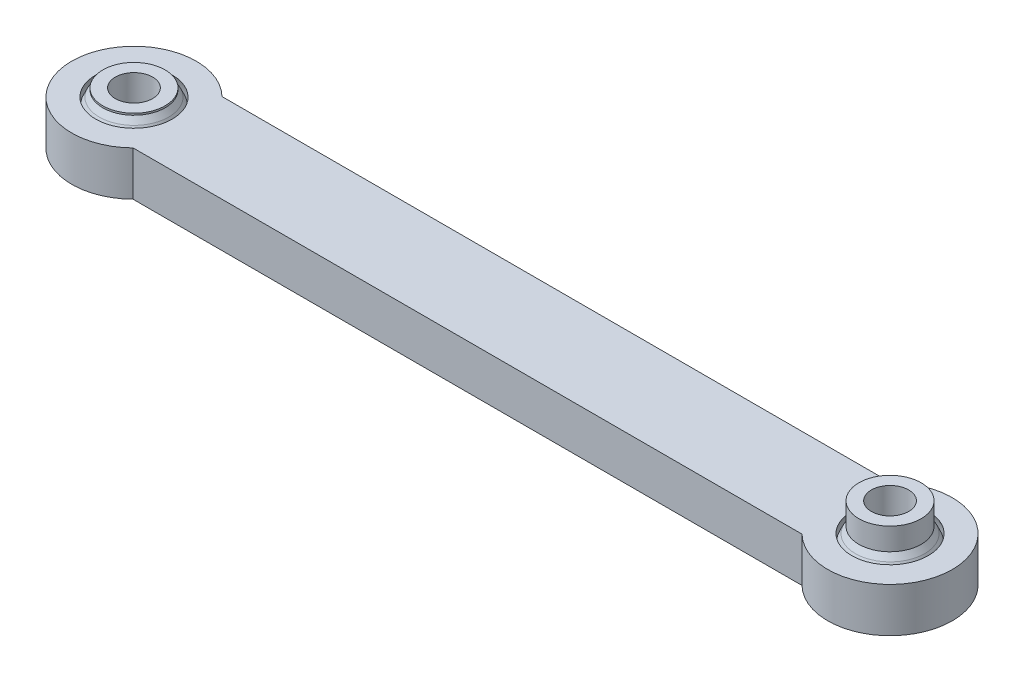
ISO-10303-21;
HEADER;
FILE_DESCRIPTION(('STEP AP214'),'2;1');
FILE_NAME('part.step','',(''),(''),'','','');
FILE_SCHEMA(('AUTOMOTIVE_DESIGN { 1 0 10303 214 1 1 1 1 }'));
ENDSEC;
DATA;
#1=APPLICATION_CONTEXT('core data for automotive mechanical design processes');
#2=APPLICATION_PROTOCOL_DEFINITION('international standard','automotive_design',2000,#1);
#3=PRODUCT_CONTEXT('',#1,'mechanical');
#4=PRODUCT('Part','Part','',(#3));
#5=PRODUCT_RELATED_PRODUCT_CATEGORY('part','',(#4));
#6=PRODUCT_DEFINITION_FORMATION('','',#4);
#7=PRODUCT_DEFINITION_CONTEXT('part definition',#1,'design');
#8=PRODUCT_DEFINITION('design','',#6,#7);
#9=PRODUCT_DEFINITION_SHAPE('','',#8);
#10=(LENGTH_UNIT() NAMED_UNIT(*) SI_UNIT(.MILLI.,.METRE.));
#11=(NAMED_UNIT(*) PLANE_ANGLE_UNIT() SI_UNIT($,.RADIAN.));
#12=(NAMED_UNIT(*) SI_UNIT($,.STERADIAN.) SOLID_ANGLE_UNIT());
#13=UNCERTAINTY_MEASURE_WITH_UNIT(LENGTH_MEASURE(1.E-05),#10,'distance_accuracy_value','');
#14=(GEOMETRIC_REPRESENTATION_CONTEXT(3) GLOBAL_UNCERTAINTY_ASSIGNED_CONTEXT((#13)) GLOBAL_UNIT_ASSIGNED_CONTEXT((#10,
#11,#12)) REPRESENTATION_CONTEXT('',''));
#15=CARTESIAN_POINT('',(0.,0.,0.));
#16=DIRECTION('',(0.,0.,1.));
#17=DIRECTION('',(1.,0.,0.));
#18=AXIS2_PLACEMENT_3D('',#15,#16,#17);
#19=CARTESIAN_POINT('',(40.,15.3455054986758,0.));
#20=DIRECTION('',(0.,1.,0.));
#21=DIRECTION('',(0.,0.,1.));
#22=AXIS2_PLACEMENT_3D('',#19,#20,#21);
#23=DEGENERATE_TOROIDAL_SURFACE('',#22,21.8682582480136,22.0876733945389,.T.);
#24=CARTESIAN_POINT('',(40.,2.5,0.));
#25=DIRECTION('',(0.,1.,0.));
#26=DIRECTION('',(0.,0.,1.));
#27=AXIS2_PLACEMENT_3D('',#24,#25,#26);
#28=CIRCLE('',#27,3.9);
#29=CARTESIAN_POINT('',(40.,2.5,3.9));
#30=VERTEX_POINT('',#29);
#31=EDGE_CURVE('E63',#30,#30,#28,.T.);
#32=ORIENTED_EDGE('',*,*,#31,.T.);
#33=EDGE_LOOP('',(#32));
#34=FACE_BOUND('',#33,.T.);
#35=CARTESIAN_POINT('',(40.,3.19999999999999,0.));
#36=DIRECTION('',(0.,-1.,0.));
#37=DIRECTION('',(0.,0.,-1.));
#38=AXIS2_PLACEMENT_3D('',#35,#36,#37);
#39=CIRCLE('',#38,3.41962653274933);
#40=CARTESIAN_POINT('',(40.,3.19999999999999,-3.41962653274933));
#41=VERTEX_POINT('',#40);
#42=EDGE_CURVE('E73',#41,#41,#39,.T.);
#43=ORIENTED_EDGE('',*,*,#42,.T.);
#44=EDGE_LOOP('',(#43));
#45=FACE_BOUND('',#44,.T.);
#46=ADVANCED_FACE('F50',(#34,#45),#23,.F.);
#47=CARTESIAN_POINT('',(40.,0.243502063584502,0.));
#48=DIRECTION('',(0.,1.,0.));
#49=DIRECTION('',(0.,0.,1.));
#50=AXIS2_PLACEMENT_3D('',#47,#48,#49);
#51=DEGENERATE_TOROIDAL_SURFACE('',#50,0.0062585982687352,4.50033388101411,.T.);
#52=CARTESIAN_POINT('',(40.,0.,0.));
#53=DIRECTION('',(0.,1.,0.));
#54=DIRECTION('',(0.,0.,1.));
#55=AXIS2_PLACEMENT_3D('',#52,#53,#54);
#56=CIRCLE('',#55,4.5);
#57=CARTESIAN_POINT('',(40.,0.,4.5));
#58=VERTEX_POINT('',#57);
#59=EDGE_CURVE('E58',#58,#58,#56,.T.);
#60=ORIENTED_EDGE('',*,*,#59,.T.);
#61=EDGE_LOOP('',(#60));
#62=FACE_BOUND('',#61,.T.);
#63=ORIENTED_EDGE('',*,*,#31,.F.);
#64=EDGE_LOOP('',(#63));
#65=FACE_BOUND('',#64,.T.);
#66=ADVANCED_FACE('F95',(#62,#65),#51,.T.);
#67=CARTESIAN_POINT('',(40.,-0.243502063584458,0.));
#68=DIRECTION('',(0.,1.,0.));
#69=DIRECTION('',(0.,0.,1.));
#70=AXIS2_PLACEMENT_3D('',#67,#68,#69);
#71=DEGENERATE_TOROIDAL_SURFACE('',#70,0.00625859826854092,4.50033388101431,.T.);
#72=CARTESIAN_POINT('',(40.,-2.5,0.));
#73=DIRECTION('',(0.,1.,0.));
#74=DIRECTION('',(0.,0.,1.));
#75=AXIS2_PLACEMENT_3D('',#72,#73,#74);
#76=CIRCLE('',#75,3.9);
#77=CARTESIAN_POINT('',(40.,-2.5,3.9));
#78=VERTEX_POINT('',#77);
#79=EDGE_CURVE('E12',#78,#78,#76,.T.);
#80=ORIENTED_EDGE('',*,*,#79,.T.);
#81=EDGE_LOOP('',(#80));
#82=FACE_BOUND('',#81,.T.);
#83=ORIENTED_EDGE('',*,*,#59,.F.);
#84=EDGE_LOOP('',(#83));
#85=FACE_BOUND('',#84,.T.);
#86=ADVANCED_FACE('F101',(#82,#85),#71,.T.);
#87=CARTESIAN_POINT('',(-5.,-2.5,0.));
#88=DIRECTION('',(0.,1.,0.));
#89=DIRECTION('',(0.,0.,1.));
#90=AXIS2_PLACEMENT_3D('',#87,#88,#89);
#91=PLANE('',#90);
#92=CARTESIAN_POINT('',(40.,-2.5,0.));
#93=DIRECTION('',(0.,1.,0.));
#94=DIRECTION('',(0.,0.,1.));
#95=AXIS2_PLACEMENT_3D('',#92,#93,#94);
#96=CIRCLE('',#95,2.1);
#97=CARTESIAN_POINT('',(40.,-2.5,2.1));
#98=VERTEX_POINT('',#97);
#99=EDGE_CURVE('E66',#98,#98,#96,.T.);
#100=ORIENTED_EDGE('',*,*,#99,.T.);
#101=EDGE_LOOP('',(#100));
#102=FACE_BOUND('',#101,.T.);
#103=ORIENTED_EDGE('',*,*,#79,.F.);
#104=EDGE_LOOP('',(#103));
#105=FACE_BOUND('',#104,.T.);
#106=ADVANCED_FACE('F105',(#102,#105),#91,.F.);
#107=CARTESIAN_POINT('',(-5.,5.69999999999999,0.));
#108=DIRECTION('',(0.,1.,0.));
#109=DIRECTION('',(0.,0.,1.));
#110=AXIS2_PLACEMENT_3D('',#107,#108,#109);
#111=PLANE('',#110);
#112=CARTESIAN_POINT('',(40.,5.69999999999999,0.));
#113=DIRECTION('',(0.,1.,0.));
#114=DIRECTION('',(0.,0.,1.));
#115=AXIS2_PLACEMENT_3D('',#112,#113,#114);
#116=CIRCLE('',#115,2.1);
#117=CARTESIAN_POINT('',(40.,5.69999999999999,2.1));
#118=VERTEX_POINT('',#117);
#119=EDGE_CURVE('E75',#118,#118,#116,.T.);
#120=ORIENTED_EDGE('',*,*,#119,.F.);
#121=EDGE_LOOP('',(#120));
#122=FACE_BOUND('',#121,.T.);
#123=CARTESIAN_POINT('',(40.,5.69999999999999,0.));
#124=DIRECTION('',(0.,1.,0.));
#125=DIRECTION('',(0.,0.,1.));
#126=AXIS2_PLACEMENT_3D('',#123,#124,#125);
#127=CIRCLE('',#126,3.5);
#128=CARTESIAN_POINT('',(40.,5.69999999999999,3.5));
#129=VERTEX_POINT('',#128);
#130=EDGE_CURVE('E71',#129,#129,#127,.T.);
#131=ORIENTED_EDGE('',*,*,#130,.T.);
#132=EDGE_LOOP('',(#131));
#133=FACE_BOUND('',#132,.T.);
#134=ADVANCED_FACE('F52',(#122,#133),#111,.T.);
#135=CARTESIAN_POINT('',(40.,-5.3,0.));
#136=DIRECTION('',(0.,1.,0.));
#137=DIRECTION('',(0.,0.,1.));
#138=AXIS2_PLACEMENT_3D('',#135,#136,#137);
#139=CYLINDRICAL_SURFACE('',#138,2.1);
#140=ORIENTED_EDGE('',*,*,#119,.T.);
#141=EDGE_LOOP('',(#140));
#142=FACE_BOUND('',#141,.T.);
#143=ORIENTED_EDGE('',*,*,#99,.F.);
#144=EDGE_LOOP('',(#143));
#145=FACE_BOUND('',#144,.T.);
#146=ADVANCED_FACE('F92',(#142,#145),#139,.F.);
#147=CARTESIAN_POINT('',(40.,3.19999999999999,0.));
#148=DIRECTION('',(0.,1.,0.));
#149=DIRECTION('',(0.,0.,1.));
#150=AXIS2_PLACEMENT_3D('',#147,#148,#149);
#151=CYLINDRICAL_SURFACE('',#150,3.5);
#152=CARTESIAN_POINT('',(40.,3.19999999999999,0.));
#153=DIRECTION('',(0.,1.,0.));
#154=DIRECTION('',(0.,0.,1.));
#155=AXIS2_PLACEMENT_3D('',#152,#153,#154);
#156=CIRCLE('',#155,3.5);
#157=CARTESIAN_POINT('',(40.,3.19999999999999,3.5));
#158=VERTEX_POINT('',#157);
#159=EDGE_CURVE('E54',#158,#158,#156,.T.);
#160=ORIENTED_EDGE('',*,*,#159,.T.);
#161=EDGE_LOOP('',(#160));
#162=FACE_BOUND('',#161,.T.);
#163=ORIENTED_EDGE('',*,*,#130,.F.);
#164=EDGE_LOOP('',(#163));
#165=FACE_BOUND('',#164,.T.);
#166=ADVANCED_FACE('F82',(#162,#165),#151,.T.);
#167=CARTESIAN_POINT('',(45.,3.19999999999999,0.));
#168=DIRECTION('',(0.,1.,0.));
#169=DIRECTION('',(0.,0.,1.));
#170=AXIS2_PLACEMENT_3D('',#167,#168,#169);
#171=PLANE('',#170);
#172=ORIENTED_EDGE('',*,*,#42,.F.);
#173=EDGE_LOOP('',(#172));
#174=FACE_BOUND('',#173,.T.);
#175=ORIENTED_EDGE('',*,*,#159,.F.);
#176=EDGE_LOOP('',(#175));
#177=FACE_BOUND('',#176,.T.);
#178=ADVANCED_FACE('F85',(#174,#177),#171,.F.);
#179=CLOSED_SHELL('',(#46,#66,#86,#106,#134,#146,#166,#178));
#180=MANIFOLD_SOLID_BREP('B2',#179);
#181=CARTESIAN_POINT('',(-45.,-5.3,0.));
#182=DIRECTION('',(0.,1.,0.));
#183=DIRECTION('',(0.,0.,1.));
#184=AXIS2_PLACEMENT_3D('',#181,#182,#183);
#185=CYLINDRICAL_SURFACE('',#184,2.1);
#186=CARTESIAN_POINT('',(-45.,-2.5,0.));
#187=DIRECTION('',(0.,-1.,0.));
#188=DIRECTION('',(0.,0.,-1.));
#189=AXIS2_PLACEMENT_3D('',#186,#187,#188);
#190=CIRCLE('',#189,2.1);
#191=CARTESIAN_POINT('',(-45.,-2.5,-2.1));
#192=VERTEX_POINT('',#191);
#193=EDGE_CURVE('E215',#192,#192,#190,.T.);
#194=ORIENTED_EDGE('',*,*,#193,.T.);
#195=EDGE_LOOP('',(#194));
#196=FACE_BOUND('',#195,.T.);
#197=CARTESIAN_POINT('',(-45.,3.4,0.));
#198=DIRECTION('',(0.,1.,0.));
#199=DIRECTION('',(0.,0.,1.));
#200=AXIS2_PLACEMENT_3D('',#197,#198,#199);
#201=CIRCLE('',#200,2.1);
#202=CARTESIAN_POINT('',(-45.,3.4,2.1));
#203=VERTEX_POINT('',#202);
#204=EDGE_CURVE('E227',#203,#203,#201,.F.);
#205=ORIENTED_EDGE('',*,*,#204,.F.);
#206=EDGE_LOOP('',(#205));
#207=FACE_BOUND('',#206,.T.);
#208=ADVANCED_FACE('F199',(#196,#207),#185,.F.);
#209=CARTESIAN_POINT('',(-45.,3.19999999999999,0.));
#210=DIRECTION('',(0.,1.,0.));
#211=DIRECTION('',(0.,0.,1.));
#212=AXIS2_PLACEMENT_3D('',#209,#210,#211);
#213=CYLINDRICAL_SURFACE('',#212,3.5);
#214=CARTESIAN_POINT('',(-45.,3.19999999999999,0.));
#215=DIRECTION('',(0.,1.,0.));
#216=DIRECTION('',(0.,0.,1.));
#217=AXIS2_PLACEMENT_3D('',#214,#215,#216);
#218=CIRCLE('',#217,3.5);
#219=CARTESIAN_POINT('',(-45.,3.19999999999999,3.5));
#220=VERTEX_POINT('',#219);
#221=EDGE_CURVE('E222',#220,#220,#218,.T.);
#222=ORIENTED_EDGE('',*,*,#221,.T.);
#223=EDGE_LOOP('',(#222));
#224=FACE_BOUND('',#223,.T.);
#225=CARTESIAN_POINT('',(-45.,3.4,0.));
#226=DIRECTION('',(0.,1.,0.));
#227=DIRECTION('',(0.,0.,1.));
#228=AXIS2_PLACEMENT_3D('',#225,#226,#227);
#229=CIRCLE('',#228,3.5);
#230=CARTESIAN_POINT('',(-45.,3.4,3.5));
#231=VERTEX_POINT('',#230);
#232=EDGE_CURVE('E203',#231,#231,#229,.F.);
#233=ORIENTED_EDGE('',*,*,#232,.T.);
#234=EDGE_LOOP('',(#233));
#235=FACE_BOUND('',#234,.T.);
#236=ADVANCED_FACE('F236',(#224,#235),#213,.T.);
#237=CARTESIAN_POINT('',(-45.,15.3455054986679,0.));
#238=DIRECTION('',(0.,-1.,0.));
#239=DIRECTION('',(0.,0.,-1.));
#240=AXIS2_PLACEMENT_3D('',#237,#238,#239);
#241=DEGENERATE_TOROIDAL_SURFACE('',#240,21.8682582480017,22.0876733945246,.T.);
#242=CARTESIAN_POINT('',(-45.,2.5,0.));
#243=DIRECTION('',(0.,-1.,0.));
#244=DIRECTION('',(0.,0.,-1.));
#245=AXIS2_PLACEMENT_3D('',#242,#243,#244);
#246=CIRCLE('',#245,3.9);
#247=CARTESIAN_POINT('',(-45.,2.5,-3.9));
#248=VERTEX_POINT('',#247);
#249=EDGE_CURVE('E49',#248,#248,#246,.T.);
#250=ORIENTED_EDGE('',*,*,#249,.F.);
#251=EDGE_LOOP('',(#250));
#252=FACE_BOUND('',#251,.T.);
#253=CARTESIAN_POINT('',(-45.,3.19999999999999,0.));
#254=DIRECTION('',(0.,-1.,0.));
#255=DIRECTION('',(0.,0.,-1.));
#256=AXIS2_PLACEMENT_3D('',#253,#254,#255);
#257=CIRCLE('',#256,3.41962653274932);
#258=CARTESIAN_POINT('',(-45.,3.19999999999999,-3.41962653274932));
#259=VERTEX_POINT('',#258);
#260=EDGE_CURVE('E217',#259,#259,#257,.T.);
#261=ORIENTED_EDGE('',*,*,#260,.T.);
#262=EDGE_LOOP('',(#261));
#263=FACE_BOUND('',#262,.T.);
#264=ADVANCED_FACE('F201',(#252,#263),#241,.F.);
#265=CARTESIAN_POINT('',(-45.,-0.243502063584499,0.));
#266=DIRECTION('',(0.,-1.,0.));
#267=DIRECTION('',(0.,0.,-1.));
#268=AXIS2_PLACEMENT_3D('',#265,#266,#267);
#269=DEGENERATE_TOROIDAL_SURFACE('',#268,0.00625859826871439,4.50033388101413,.T.);
#270=CARTESIAN_POINT('',(-45.,0.,0.));
#271=DIRECTION('',(0.,-1.,0.));
#272=DIRECTION('',(0.,0.,-1.));
#273=AXIS2_PLACEMENT_3D('',#270,#271,#272);
#274=CIRCLE('',#273,4.5);
#275=CARTESIAN_POINT('',(-45.,0.,-4.5));
#276=VERTEX_POINT('',#275);
#277=EDGE_CURVE('E207',#276,#276,#274,.T.);
#278=ORIENTED_EDGE('',*,*,#277,.T.);
#279=EDGE_LOOP('',(#278));
#280=FACE_BOUND('',#279,.T.);
#281=CARTESIAN_POINT('',(-45.,-2.5,0.));
#282=DIRECTION('',(0.,-1.,0.));
#283=DIRECTION('',(0.,0.,-1.));
#284=AXIS2_PLACEMENT_3D('',#281,#282,#283);
#285=CIRCLE('',#284,3.9);
#286=CARTESIAN_POINT('',(-45.,-2.5,-3.9));
#287=VERTEX_POINT('',#286);
#288=EDGE_CURVE('E212',#287,#287,#285,.T.);
#289=ORIENTED_EDGE('',*,*,#288,.F.);
#290=EDGE_LOOP('',(#289));
#291=FACE_BOUND('',#290,.T.);
#292=ADVANCED_FACE('F260',(#280,#291),#269,.T.);
#293=CARTESIAN_POINT('',(0.,-2.5,0.));
#294=DIRECTION('',(0.,-1.,0.));
#295=DIRECTION('',(0.,0.,-1.));
#296=AXIS2_PLACEMENT_3D('',#293,#294,#295);
#297=PLANE('',#296);
#298=ORIENTED_EDGE('',*,*,#193,.F.);
#299=EDGE_LOOP('',(#298));
#300=FACE_BOUND('',#299,.T.);
#301=ORIENTED_EDGE('',*,*,#288,.T.);
#302=EDGE_LOOP('',(#301));
#303=FACE_BOUND('',#302,.T.);
#304=ADVANCED_FACE('F257',(#300,#303),#297,.T.);
#305=CARTESIAN_POINT('',(-45.,0.243502063584498,0.));
#306=DIRECTION('',(0.,-1.,0.));
#307=DIRECTION('',(0.,0.,-1.));
#308=AXIS2_PLACEMENT_3D('',#305,#306,#307);
#309=DEGENERATE_TOROIDAL_SURFACE('',#308,0.00625859826871439,4.50033388101413,.T.);
#310=ORIENTED_EDGE('',*,*,#277,.F.);
#311=EDGE_LOOP('',(#310));
#312=FACE_BOUND('',#311,.T.);
#313=ORIENTED_EDGE('',*,*,#249,.T.);
#314=EDGE_LOOP('',(#313));
#315=FACE_BOUND('',#314,.T.);
#316=ADVANCED_FACE('F245',(#312,#315),#309,.T.);
#317=CARTESIAN_POINT('',(-45.,3.19999999999999,0.));
#318=DIRECTION('',(0.,1.,0.));
#319=DIRECTION('',(0.,0.,1.));
#320=AXIS2_PLACEMENT_3D('',#317,#318,#319);
#321=PLANE('',#320);
#322=ORIENTED_EDGE('',*,*,#260,.F.);
#323=EDGE_LOOP('',(#322));
#324=FACE_BOUND('',#323,.T.);
#325=ORIENTED_EDGE('',*,*,#221,.F.);
#326=EDGE_LOOP('',(#325));
#327=FACE_BOUND('',#326,.T.);
#328=ADVANCED_FACE('F240',(#324,#327),#321,.F.);
#329=CARTESIAN_POINT('',(-45.,3.4,0.));
#330=DIRECTION('',(0.,1.,0.));
#331=DIRECTION('',(0.,0.,1.));
#332=AXIS2_PLACEMENT_3D('',#329,#330,#331);
#333=PLANE('',#332);
#334=ORIENTED_EDGE('',*,*,#232,.F.);
#335=EDGE_LOOP('',(#334));
#336=FACE_BOUND('',#335,.T.);
#337=ORIENTED_EDGE('',*,*,#204,.T.);
#338=EDGE_LOOP('',(#337));
#339=FACE_BOUND('',#338,.T.);
#340=ADVANCED_FACE('F238',(#336,#339),#333,.T.);
#341=CLOSED_SHELL('',(#208,#236,#264,#292,#304,#316,#328,#340));
#342=MANIFOLD_SOLID_BREP('B7',#341);
#343=CARTESIAN_POINT('',(-45.,0.,0.));
#344=DIRECTION('',(0.,-1.,0.));
#345=DIRECTION('',(-1.,0.,0.));
#346=AXIS2_PLACEMENT_3D('',#343,#344,#345);
#347=SPHERICAL_SURFACE('',#346,4.97393204617835);
#348=CARTESIAN_POINT('',(-45.,-2.5,0.));
#349=DIRECTION('',(0.,-1.,0.));
#350=DIRECTION('',(0.,0.,-1.));
#351=AXIS2_PLACEMENT_3D('',#348,#349,#350);
#352=CIRCLE('',#351,4.3);
#353=CARTESIAN_POINT('',(-49.3,-2.5,0.));
#354=VERTEX_POINT('',#353);
#355=EDGE_CURVE('E413',#354,#354,#352,.T.);
#356=CARTESIAN_POINT('',(-45.,2.5,0.));
#357=DIRECTION('',(0.,-1.,0.));
#358=DIRECTION('',(0.,0.,-1.));
#359=AXIS2_PLACEMENT_3D('',#356,#357,#358);
#360=CIRCLE('',#359,4.3);
#361=CARTESIAN_POINT('',(-49.3,2.5,0.));
#362=VERTEX_POINT('',#361);
#363=EDGE_CURVE('E197',#362,#362,#360,.T.);
#364=CARTESIAN_POINT('',(-49.3,-2.5,0.));
#365=CARTESIAN_POINT('',(-49.3274288112124,-2.45282313948663,0.));
#366=CARTESIAN_POINT('',(-49.3540806222823,-2.40519455774077,0.));
#367=CARTESIAN_POINT('',(-49.4058027247808,-2.30908627244392,0.));
#368=CARTESIAN_POINT('',(-49.4308730162095,-2.26060656889293,0.));
#369=CARTESIAN_POINT('',(-49.4794045600695,-2.16284836064569,0.));
#370=CARTESIAN_POINT('',(-49.5028658125008,-2.11356985594945,0.));
#371=CARTESIAN_POINT('',(-49.5481539610409,-2.01426747841306,0.));
#372=CARTESIAN_POINT('',(-49.5699808571497,-1.96424360557292,0.));
#373=CARTESIAN_POINT('',(-49.6119766231307,-1.86350466597311,0.));
#374=CARTESIAN_POINT('',(-49.6321454930029,-1.81278959921345,0.));
#375=CARTESIAN_POINT('',(-49.6708033656067,-1.7107232124696,0.));
#376=CARTESIAN_POINT('',(-49.6892923683383,-1.65937189248542,0.));
#377=CARTESIAN_POINT('',(-49.7245704766368,-1.55608862445439,0.));
#378=CARTESIAN_POINT('',(-49.7413595822037,-1.50415667640755,0.));
#379=CARTESIAN_POINT('',(-49.7732197099238,-1.39976840765016,0.));
#380=CARTESIAN_POINT('',(-49.7882907320769,-1.3473120869396,0.));
#381=CARTESIAN_POINT('',(-49.8166983671951,-1.24193189593766,0.));
#382=CARTESIAN_POINT('',(-49.8300349801601,-1.18900802564628,0.));
#383=CARTESIAN_POINT('',(-49.8549593500911,-1.08275006512867,0.));
#384=CARTESIAN_POINT('',(-49.8665471070572,-1.02941597490246,0.));
#385=CARTESIAN_POINT('',(-49.887961212577,-0.922395348506252,0.));
#386=CARTESIAN_POINT('',(-49.8977875611309,-0.86870881233626,0.));
#387=CARTESIAN_POINT('',(-49.9156682054658,-0.76104144983614,0.));
#388=CARTESIAN_POINT('',(-49.9237225012468,-0.707060623506012,0.));
#389=CARTESIAN_POINT('',(-49.9380503152433,-0.598863155256457,0.));
#390=CARTESIAN_POINT('',(-49.9443238334587,-0.544646513337029,0.));
#391=CARTESIAN_POINT('',(-49.9550832965538,-0.436036143926722,0.));
#392=CARTESIAN_POINT('',(-49.9595692414336,-0.381642416435843,0.));
#393=CARTESIAN_POINT('',(-49.9667486984709,-0.272736797727778,0.));
#394=CARTESIAN_POINT('',(-49.9694422106285,-0.218224906510593,0.));
#395=CARTESIAN_POINT('',(-49.9730338844822,-0.109142010195605,0.));
#396=CARTESIAN_POINT('',(-49.9739320461784,-0.0545710050978024,0.));
#397=CARTESIAN_POINT('',(-49.9739320461784,0.0545710050978025,0.));
#398=CARTESIAN_POINT('',(-49.9730338844822,0.109142010195605,0.));
#399=CARTESIAN_POINT('',(-49.9694422106285,0.218224906510593,0.));
#400=CARTESIAN_POINT('',(-49.9667486984709,0.272736797727778,0.));
#401=CARTESIAN_POINT('',(-49.9595692414336,0.381642416435843,0.));
#402=CARTESIAN_POINT('',(-49.9550832965538,0.436036143926722,0.));
#403=CARTESIAN_POINT('',(-49.9443238334587,0.544646513337029,0.));
#404=CARTESIAN_POINT('',(-49.9380503152433,0.598863155256457,0.));
#405=CARTESIAN_POINT('',(-49.9237225012468,0.707060623506012,0.));
#406=CARTESIAN_POINT('',(-49.9156682054658,0.761041449836139,0.));
#407=CARTESIAN_POINT('',(-49.8977875611309,0.86870881233626,0.));
#408=CARTESIAN_POINT('',(-49.887961212577,0.922395348506252,0.));
#409=CARTESIAN_POINT('',(-49.8665471070572,1.02941597490246,0.));
#410=CARTESIAN_POINT('',(-49.8549593500911,1.08275006512867,0.));
#411=CARTESIAN_POINT('',(-49.8300349801601,1.18900802564628,0.));
#412=CARTESIAN_POINT('',(-49.8166983671951,1.24193189593766,0.));
#413=CARTESIAN_POINT('',(-49.7882907320769,1.3473120869396,0.));
#414=CARTESIAN_POINT('',(-49.7732197099238,1.39976840765016,0.));
#415=CARTESIAN_POINT('',(-49.7413595822037,1.50415667640755,0.));
#416=CARTESIAN_POINT('',(-49.7245704766368,1.55608862445439,0.));
#417=CARTESIAN_POINT('',(-49.6892923683383,1.65937189248542,0.));
#418=CARTESIAN_POINT('',(-49.6708033656067,1.7107232124696,0.));
#419=CARTESIAN_POINT('',(-49.6321454930029,1.81278959921345,0.));
#420=CARTESIAN_POINT('',(-49.6119766231307,1.86350466597311,0.));
#421=CARTESIAN_POINT('',(-49.5699808571497,1.96424360557292,0.));
#422=CARTESIAN_POINT('',(-49.5481539610409,2.01426747841306,0.));
#423=CARTESIAN_POINT('',(-49.5028658125008,2.11356985594945,0.));
#424=CARTESIAN_POINT('',(-49.4794045600695,2.16284836064569,0.));
#425=CARTESIAN_POINT('',(-49.4308730162095,2.26060656889293,0.));
#426=CARTESIAN_POINT('',(-49.4058027247808,2.30908627244392,0.));
#427=CARTESIAN_POINT('',(-49.3540806222823,2.40519455774077,0.));
#428=CARTESIAN_POINT('',(-49.3274288112124,2.45282313948663,0.));
#429=CARTESIAN_POINT('',(-49.3,2.5,0.));
#430=B_SPLINE_CURVE_WITH_KNOTS('',3,(#364,#365,#366,#367,#368,#369,#370,#371,#372,#373,#374,
#375,#376,#377,#378,#379,#380,#381,#382,#383,#384,#385,#386,#387,#388,#389,#390,#391,#392,#393,
#394,#395,#396,#397,#398,#399,#400,#401,#402,#403,#404,#405,#406,#407,#408,#409,#410,#411,#412,
#413,#414,#415,#416,#417,#418,#419,#420,#421,#422,#423,#424,#425,#426,#427,#428,#429),
.UNSPECIFIED.,.F.,.F.,(4,2,2,2,2,2,2,2,2,2,2,2,2,2,2,2,2,2,2,2,2,2,2,2,2,2,2,2,2,2,2,2,4),(0.,
0.163705626558807,0.327411253117615,0.491116879676421,0.654822506235227,0.818528132794034,
0.982233759352842,1.14593938591165,1.30964501247046,1.47335063902926,1.63705626558807,
1.80076189214688,1.96446751870568,2.12817314526449,2.2918787718233,2.4555843983821,
2.61929002494091,2.78299565149972,2.94670127805853,3.11040690461733,3.27411253117614,
3.43781815773495,3.60152378429375,3.76522941085256,3.92893503741137,4.09264066397017,
4.25634629052898,4.42005191708779,4.5837575436466,4.7474631702054,4.91116879676421,
5.07487442332302,5.23858004988182),.UNSPECIFIED.);
#431=EDGE_CURVE('BSEAM334',#354,#362,#430,.T.);
#432=ORIENTED_EDGE('',*,*,#355,.T.);
#433=ORIENTED_EDGE('',*,*,#363,.F.);
#434=ORIENTED_EDGE('',*,*,#431,.T.);
#435=ORIENTED_EDGE('',*,*,#431,.F.);
#436=EDGE_LOOP('',(#432,#434,#433,#435));
#437=FACE_BOUND('',#436,.T.);
#438=ADVANCED_FACE('F334',(#437),#347,.F.);
#439=CARTESIAN_POINT('',(-45.,-2.50000000000001,0.));
#440=DIRECTION('',(0.,-1.,0.));
#441=DIRECTION('',(0.,0.,-1.));
#442=AXIS2_PLACEMENT_3D('',#439,#440,#441);
#443=CYLINDRICAL_SURFACE('',#442,7.);
#444=CARTESIAN_POINT('',(-45.,-2.5,0.));
#445=DIRECTION('',(0.,-1.,0.));
#446=DIRECTION('',(0.,0.,-1.));
#447=AXIS2_PLACEMENT_3D('',#444,#445,#446);
#448=CIRCLE('',#447,7.);
#449=CARTESIAN_POINT('',(-40.1010205144336,-2.5,5.));
#450=VERTEX_POINT('',#449);
#451=CARTESIAN_POINT('',(-40.1010205144336,-2.5,-5.));
#452=VERTEX_POINT('',#451);
#453=EDGE_CURVE('E356',#450,#452,#448,.T.);
#454=ORIENTED_EDGE('',*,*,#453,.F.);
#455=DIRECTION('',(0.,1.,0.));
#456=VECTOR('',#455,1.);
#457=CARTESIAN_POINT('',(-40.1010205144336,-2.5,5.));
#458=LINE('',#457,#456);
#459=CARTESIAN_POINT('',(-40.1010205144336,2.5,5.));
#460=VERTEX_POINT('',#459);
#461=EDGE_CURVE('E381',#450,#460,#458,.T.);
#462=ORIENTED_EDGE('',*,*,#461,.T.);
#463=CARTESIAN_POINT('',(-45.,2.5,0.));
#464=DIRECTION('',(0.,-1.,0.));
#465=DIRECTION('',(0.,0.,-1.));
#466=AXIS2_PLACEMENT_3D('',#463,#464,#465);
#467=CIRCLE('',#466,7.);
#468=CARTESIAN_POINT('',(-40.1010205144336,2.5,-5.));
#469=VERTEX_POINT('',#468);
#470=EDGE_CURVE('E341',#460,#469,#467,.T.);
#471=ORIENTED_EDGE('',*,*,#470,.T.);
#472=DIRECTION('',(0.,1.,0.));
#473=VECTOR('',#472,1.);
#474=CARTESIAN_POINT('',(-40.1010205144336,-2.5,-5.));
#475=LINE('',#474,#473);
#476=EDGE_CURVE('E384',#452,#469,#475,.T.);
#477=ORIENTED_EDGE('',*,*,#476,.F.);
#478=EDGE_LOOP('',(#454,#462,#471,#477));
#479=FACE_BOUND('',#478,.T.);
#480=ADVANCED_FACE('F418',(#479),#443,.T.);
#481=CARTESIAN_POINT('',(-40.1010205144336,-2.5,-5.));
#482=DIRECTION('',(0.,0.,-1.));
#483=DIRECTION('',(-1.,0.,0.));
#484=AXIS2_PLACEMENT_3D('',#481,#482,#483);
#485=PLANE('',#484);
#486=ORIENTED_EDGE('',*,*,#476,.T.);
#487=DIRECTION('',(-1.,0.,0.));
#488=VECTOR('',#487,1.);
#489=CARTESIAN_POINT('',(-40.1010205144336,2.5,-5.));
#490=LINE('',#489,#488);
#491=CARTESIAN_POINT('',(35.1010205144336,2.5,-5.));
#492=VERTEX_POINT('',#491);
#493=EDGE_CURVE('E348',#492,#469,#490,.T.);
#494=ORIENTED_EDGE('',*,*,#493,.F.);
#495=DIRECTION('',(0.,1.,0.));
#496=VECTOR('',#495,1.);
#497=CARTESIAN_POINT('',(35.1010205144336,-2.5,-5.));
#498=LINE('',#497,#496);
#499=CARTESIAN_POINT('',(35.1010205144336,-2.5,-5.));
#500=VERTEX_POINT('',#499);
#501=EDGE_CURVE('E406',#500,#492,#498,.T.);
#502=ORIENTED_EDGE('',*,*,#501,.F.);
#503=DIRECTION('',(-1.,0.,0.));
#504=VECTOR('',#503,1.);
#505=CARTESIAN_POINT('',(-40.1010205144336,-2.5,-5.));
#506=LINE('',#505,#504);
#507=EDGE_CURVE('E385',#500,#452,#506,.T.);
#508=ORIENTED_EDGE('',*,*,#507,.T.);
#509=EDGE_LOOP('',(#486,#494,#502,#508));
#510=FACE_BOUND('',#509,.T.);
#511=ADVANCED_FACE('F420',(#510),#485,.T.);
#512=CARTESIAN_POINT('',(40.1010205144336,-2.5,5.));
#513=DIRECTION('',(0.,0.,1.));
#514=DIRECTION('',(1.,0.,0.));
#515=AXIS2_PLACEMENT_3D('',#512,#513,#514);
#516=PLANE('',#515);
#517=DIRECTION('',(1.,0.,0.));
#518=VECTOR('',#517,1.);
#519=CARTESIAN_POINT('',(40.1010205144336,-2.5,5.));
#520=LINE('',#519,#518);
#521=CARTESIAN_POINT('',(35.1010205144336,-2.5,5.));
#522=VERTEX_POINT('',#521);
#523=EDGE_CURVE('E376',#450,#522,#520,.T.);
#524=ORIENTED_EDGE('',*,*,#523,.T.);
#525=DIRECTION('',(0.,1.,0.));
#526=VECTOR('',#525,1.);
#527=CARTESIAN_POINT('',(35.1010205144336,-2.5,5.));
#528=LINE('',#527,#526);
#529=CARTESIAN_POINT('',(35.1010205144336,2.5,5.));
#530=VERTEX_POINT('',#529);
#531=EDGE_CURVE('E380',#522,#530,#528,.T.);
#532=ORIENTED_EDGE('',*,*,#531,.T.);
#533=DIRECTION('',(1.,0.,0.));
#534=VECTOR('',#533,1.);
#535=CARTESIAN_POINT('',(40.1010205144336,2.5,5.));
#536=LINE('',#535,#534);
#537=EDGE_CURVE('E408',#460,#530,#536,.T.);
#538=ORIENTED_EDGE('',*,*,#537,.F.);
#539=ORIENTED_EDGE('',*,*,#461,.F.);
#540=EDGE_LOOP('',(#524,#532,#538,#539));
#541=FACE_BOUND('',#540,.T.);
#542=ADVANCED_FACE('F378',(#541),#516,.T.);
#543=CARTESIAN_POINT('',(0.,-2.5,0.));
#544=DIRECTION('',(0.,-1.,0.));
#545=DIRECTION('',(0.,0.,-1.));
#546=AXIS2_PLACEMENT_3D('',#543,#544,#545);
#547=PLANE('',#546);
#548=ORIENTED_EDGE('',*,*,#453,.T.);
#549=ORIENTED_EDGE('',*,*,#507,.F.);
#550=CARTESIAN_POINT('',(40.,-2.5,0.));
#551=DIRECTION('',(0.,-1.,0.));
#552=DIRECTION('',(0.,0.,-1.));
#553=AXIS2_PLACEMENT_3D('',#550,#551,#552);
#554=CIRCLE('',#553,7.);
#555=EDGE_CURVE('E392',#500,#522,#554,.T.);
#556=ORIENTED_EDGE('',*,*,#555,.T.);
#557=ORIENTED_EDGE('',*,*,#523,.F.);
#558=EDGE_LOOP('',(#548,#549,#556,#557));
#559=FACE_BOUND('',#558,.T.);
#560=ORIENTED_EDGE('',*,*,#355,.F.);
#561=EDGE_LOOP('',(#560));
#562=FACE_BOUND('',#561,.T.);
#563=CARTESIAN_POINT('',(40.,-2.5,0.));
#564=DIRECTION('',(0.,-1.,0.));
#565=DIRECTION('',(0.,0.,-1.));
#566=AXIS2_PLACEMENT_3D('',#563,#564,#565);
#567=CIRCLE('',#566,4.3);
#568=CARTESIAN_POINT('',(44.3,-2.5,0.));
#569=VERTEX_POINT('',#568);
#570=EDGE_CURVE('E395',#569,#569,#567,.T.);
#571=ORIENTED_EDGE('',*,*,#570,.F.);
#572=EDGE_LOOP('',(#571));
#573=FACE_BOUND('',#572,.T.);
#574=ADVANCED_FACE('F397',(#559,#562,#573),#547,.T.);
#575=CARTESIAN_POINT('',(0.,2.5,0.));
#576=DIRECTION('',(0.,-1.,0.));
#577=DIRECTION('',(0.,0.,-1.));
#578=AXIS2_PLACEMENT_3D('',#575,#576,#577);
#579=PLANE('',#578);
#580=ORIENTED_EDGE('',*,*,#537,.T.);
#581=CARTESIAN_POINT('',(40.,2.5,0.));
#582=DIRECTION('',(0.,-1.,0.));
#583=DIRECTION('',(0.,0.,-1.));
#584=AXIS2_PLACEMENT_3D('',#581,#582,#583);
#585=CIRCLE('',#584,7.);
#586=EDGE_CURVE('E394',#492,#530,#585,.T.);
#587=ORIENTED_EDGE('',*,*,#586,.F.);
#588=ORIENTED_EDGE('',*,*,#493,.T.);
#589=ORIENTED_EDGE('',*,*,#470,.F.);
#590=EDGE_LOOP('',(#580,#587,#588,#589));
#591=FACE_BOUND('',#590,.T.);
#592=ORIENTED_EDGE('',*,*,#363,.T.);
#593=EDGE_LOOP('',(#592));
#594=FACE_BOUND('',#593,.T.);
#595=CARTESIAN_POINT('',(40.,2.5,0.));
#596=DIRECTION('',(0.,-1.,0.));
#597=DIRECTION('',(0.,0.,-1.));
#598=AXIS2_PLACEMENT_3D('',#595,#596,#597);
#599=CIRCLE('',#598,4.3);
#600=CARTESIAN_POINT('',(44.3,2.5,0.));
#601=VERTEX_POINT('',#600);
#602=EDGE_CURVE('E399',#601,#601,#599,.T.);
#603=ORIENTED_EDGE('',*,*,#602,.T.);
#604=EDGE_LOOP('',(#603));
#605=FACE_BOUND('',#604,.T.);
#606=ADVANCED_FACE('F421',(#591,#594,#605),#579,.F.);
#607=CARTESIAN_POINT('',(40.,0.,0.));
#608=DIRECTION('',(0.,-1.,0.));
#609=DIRECTION('',(1.,0.,0.));
#610=AXIS2_PLACEMENT_3D('',#607,#608,#609);
#611=SPHERICAL_SURFACE('',#610,4.97393204617835);
#612=CARTESIAN_POINT('',(44.3,-2.5,0.));
#613=CARTESIAN_POINT('',(44.3274288112124,-2.45282313948663,0.));
#614=CARTESIAN_POINT('',(44.3540806222823,-2.40519455774077,0.));
#615=CARTESIAN_POINT('',(44.4058027247808,-2.30908627244392,0.));
#616=CARTESIAN_POINT('',(44.4308730162095,-2.26060656889293,0.));
#617=CARTESIAN_POINT('',(44.4794045600695,-2.16284836064569,0.));
#618=CARTESIAN_POINT('',(44.5028658125008,-2.11356985594945,0.));
#619=CARTESIAN_POINT('',(44.5481539610409,-2.01426747841306,0.));
#620=CARTESIAN_POINT('',(44.5699808571497,-1.96424360557291,0.));
#621=CARTESIAN_POINT('',(44.6119766231307,-1.86350466597311,0.));
#622=CARTESIAN_POINT('',(44.6321454930029,-1.81278959921345,0.));
#623=CARTESIAN_POINT('',(44.6708033656067,-1.7107232124696,0.));
#624=CARTESIAN_POINT('',(44.6892923683383,-1.65937189248542,0.));
#625=CARTESIAN_POINT('',(44.7245704766368,-1.55608862445439,0.));
#626=CARTESIAN_POINT('',(44.7413595822037,-1.50415667640755,0.));
#627=CARTESIAN_POINT('',(44.7732197099238,-1.39976840765016,0.));
#628=CARTESIAN_POINT('',(44.7882907320769,-1.3473120869396,0.));
#629=CARTESIAN_POINT('',(44.8166983671951,-1.24193189593766,0.));
#630=CARTESIAN_POINT('',(44.8300349801601,-1.18900802564628,0.));
#631=CARTESIAN_POINT('',(44.8549593500911,-1.08275006512867,0.));
#632=CARTESIAN_POINT('',(44.8665471070572,-1.02941597490246,0.));
#633=CARTESIAN_POINT('',(44.8879612125771,-0.922395348506252,0.));
#634=CARTESIAN_POINT('',(44.8977875611309,-0.86870881233626,0.));
#635=CARTESIAN_POINT('',(44.9156682054658,-0.76104144983614,0.));
#636=CARTESIAN_POINT('',(44.9237225012468,-0.707060623506012,0.));
#637=CARTESIAN_POINT('',(44.9380503152433,-0.598863155256457,0.));
#638=CARTESIAN_POINT('',(44.9443238334587,-0.544646513337029,0.));
#639=CARTESIAN_POINT('',(44.9550832965538,-0.436036143926722,0.));
#640=CARTESIAN_POINT('',(44.9595692414336,-0.381642416435843,0.));
#641=CARTESIAN_POINT('',(44.9667486984709,-0.272736797727778,0.));
#642=CARTESIAN_POINT('',(44.9694422106285,-0.218224906510593,0.));
#643=CARTESIAN_POINT('',(44.9730338844822,-0.109142010195605,0.));
#644=CARTESIAN_POINT('',(44.9739320461784,-0.0545710050978024,0.));
#645=CARTESIAN_POINT('',(44.9739320461784,0.0545710050978025,0.));
#646=CARTESIAN_POINT('',(44.9730338844822,0.109142010195605,0.));
#647=CARTESIAN_POINT('',(44.9694422106285,0.218224906510593,0.));
#648=CARTESIAN_POINT('',(44.9667486984709,0.272736797727778,0.));
#649=CARTESIAN_POINT('',(44.9595692414336,0.381642416435843,0.));
#650=CARTESIAN_POINT('',(44.9550832965538,0.436036143926722,0.));
#651=CARTESIAN_POINT('',(44.9443238334587,0.544646513337029,0.));
#652=CARTESIAN_POINT('',(44.9380503152433,0.598863155256457,0.));
#653=CARTESIAN_POINT('',(44.9237225012468,0.707060623506012,0.));
#654=CARTESIAN_POINT('',(44.9156682054658,0.761041449836139,0.));
#655=CARTESIAN_POINT('',(44.8977875611309,0.86870881233626,0.));
#656=CARTESIAN_POINT('',(44.8879612125771,0.922395348506252,0.));
#657=CARTESIAN_POINT('',(44.8665471070572,1.02941597490246,0.));
#658=CARTESIAN_POINT('',(44.8549593500911,1.08275006512867,0.));
#659=CARTESIAN_POINT('',(44.8300349801601,1.18900802564628,0.));
#660=CARTESIAN_POINT('',(44.8166983671951,1.24193189593766,0.));
#661=CARTESIAN_POINT('',(44.7882907320769,1.3473120869396,0.));
#662=CARTESIAN_POINT('',(44.7732197099238,1.39976840765016,0.));
#663=CARTESIAN_POINT('',(44.7413595822037,1.50415667640755,0.));
#664=CARTESIAN_POINT('',(44.7245704766368,1.55608862445439,0.));
#665=CARTESIAN_POINT('',(44.6892923683383,1.65937189248542,0.));
#666=CARTESIAN_POINT('',(44.6708033656067,1.7107232124696,0.));
#667=CARTESIAN_POINT('',(44.6321454930029,1.81278959921345,0.));
#668=CARTESIAN_POINT('',(44.6119766231307,1.86350466597311,0.));
#669=CARTESIAN_POINT('',(44.5699808571497,1.96424360557291,0.));
#670=CARTESIAN_POINT('',(44.5481539610409,2.01426747841306,0.));
#671=CARTESIAN_POINT('',(44.5028658125008,2.11356985594945,0.));
#672=CARTESIAN_POINT('',(44.4794045600695,2.16284836064569,0.));
#673=CARTESIAN_POINT('',(44.4308730162095,2.26060656889293,0.));
#674=CARTESIAN_POINT('',(44.4058027247808,2.30908627244392,0.));
#675=CARTESIAN_POINT('',(44.3540806222823,2.40519455774077,0.));
#676=CARTESIAN_POINT('',(44.3274288112124,2.45282313948663,0.));
#677=CARTESIAN_POINT('',(44.3,2.5,0.));
#678=B_SPLINE_CURVE_WITH_KNOTS('',3,(#612,#613,#614,#615,#616,#617,#618,#619,#620,#621,#622,
#623,#624,#625,#626,#627,#628,#629,#630,#631,#632,#633,#634,#635,#636,#637,#638,#639,#640,#641,
#642,#643,#644,#645,#646,#647,#648,#649,#650,#651,#652,#653,#654,#655,#656,#657,#658,#659,#660,
#661,#662,#663,#664,#665,#666,#667,#668,#669,#670,#671,#672,#673,#674,#675,#676,#677),
.UNSPECIFIED.,.F.,.F.,(4,2,2,2,2,2,2,2,2,2,2,2,2,2,2,2,2,2,2,2,2,2,2,2,2,2,2,2,2,2,2,2,4),(0.,
0.163705626558807,0.327411253117615,0.491116879676421,0.654822506235227,0.818528132794036,
0.982233759352842,1.14593938591165,1.30964501247046,1.47335063902926,1.63705626558807,
1.80076189214688,1.96446751870568,2.12817314526449,2.2918787718233,2.4555843983821,
2.61929002494091,2.78299565149972,2.94670127805853,3.11040690461733,3.27411253117614,
3.43781815773495,3.60152378429375,3.76522941085256,3.92893503741137,4.09264066397017,
4.25634629052898,4.42005191708779,4.5837575436466,4.7474631702054,4.91116879676421,
5.07487442332302,5.23858004988182),.UNSPECIFIED.);
#679=EDGE_CURVE('BSEAM424',#569,#601,#678,.T.);
#680=ORIENTED_EDGE('',*,*,#570,.T.);
#681=ORIENTED_EDGE('',*,*,#602,.F.);
#682=ORIENTED_EDGE('',*,*,#679,.T.);
#683=ORIENTED_EDGE('',*,*,#679,.F.);
#684=EDGE_LOOP('',(#680,#682,#681,#683));
#685=FACE_BOUND('',#684,.T.);
#686=ADVANCED_FACE('F424',(#685),#611,.F.);
#687=CARTESIAN_POINT('',(40.,-2.49999999999999,0.));
#688=DIRECTION('',(0.,-1.,0.));
#689=DIRECTION('',(0.,0.,-1.));
#690=AXIS2_PLACEMENT_3D('',#687,#688,#689);
#691=CYLINDRICAL_SURFACE('',#690,7.);
#692=ORIENTED_EDGE('',*,*,#501,.T.);
#693=ORIENTED_EDGE('',*,*,#586,.T.);
#694=ORIENTED_EDGE('',*,*,#531,.F.);
#695=ORIENTED_EDGE('',*,*,#555,.F.);
#696=EDGE_LOOP('',(#692,#693,#694,#695));
#697=FACE_BOUND('',#696,.T.);
#698=ADVANCED_FACE('F391',(#697),#691,.T.);
#699=CLOSED_SHELL('',(#438,#480,#511,#542,#574,#606,#686,#698));
#700=MANIFOLD_SOLID_BREP('B44',#699);
#701=ADVANCED_BREP_SHAPE_REPRESENTATION('',(#18,#180,#342,#700),#14);
#702=SHAPE_DEFINITION_REPRESENTATION(#9,#701);
ENDSEC;
END-ISO-10303-21;
